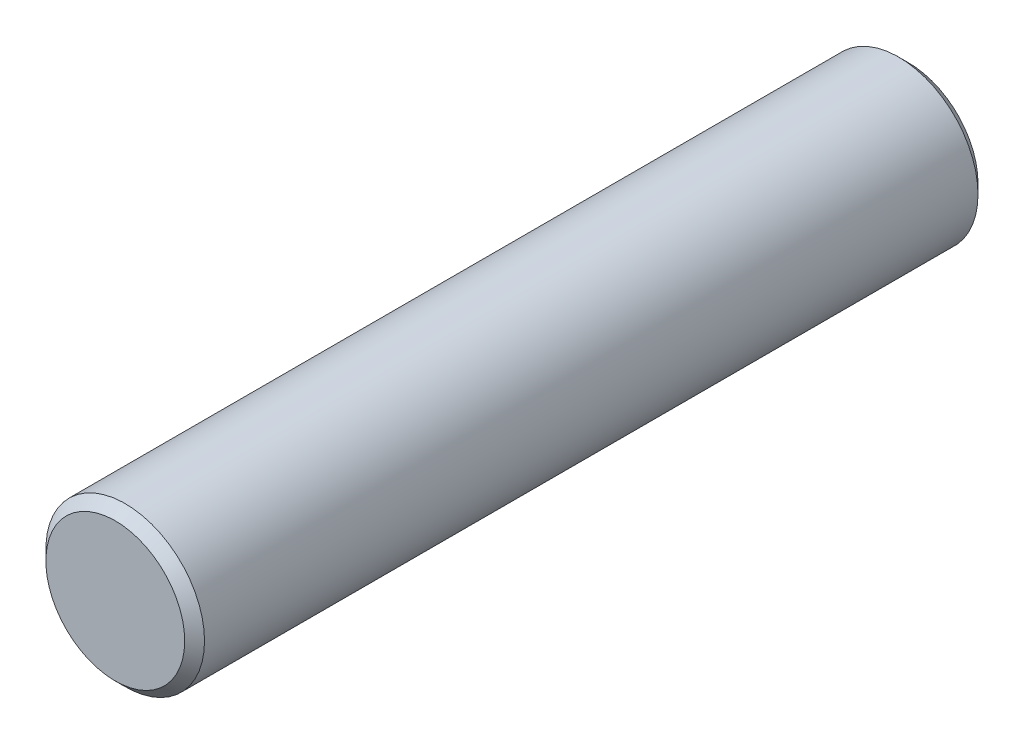
ISO-10303-21;
HEADER;
FILE_DESCRIPTION(('STEP AP214'),'2;1');
FILE_NAME('part.step','',(''),(''),'','','');
FILE_SCHEMA(('AUTOMOTIVE_DESIGN { 1 0 10303 214 1 1 1 1 }'));
ENDSEC;
DATA;
#1=APPLICATION_CONTEXT('core data for automotive mechanical design processes');
#2=APPLICATION_PROTOCOL_DEFINITION('international standard','automotive_design',2000,#1);
#3=PRODUCT_CONTEXT('',#1,'mechanical');
#4=PRODUCT('Part','Part','',(#3));
#5=PRODUCT_RELATED_PRODUCT_CATEGORY('part','',(#4));
#6=PRODUCT_DEFINITION_FORMATION('','',#4);
#7=PRODUCT_DEFINITION_CONTEXT('part definition',#1,'design');
#8=PRODUCT_DEFINITION('design','',#6,#7);
#9=PRODUCT_DEFINITION_SHAPE('','',#8);
#10=(LENGTH_UNIT() NAMED_UNIT(*) SI_UNIT(.MILLI.,.METRE.));
#11=(NAMED_UNIT(*) PLANE_ANGLE_UNIT() SI_UNIT($,.RADIAN.));
#12=(NAMED_UNIT(*) SI_UNIT($,.STERADIAN.) SOLID_ANGLE_UNIT());
#13=UNCERTAINTY_MEASURE_WITH_UNIT(LENGTH_MEASURE(1.E-05),#10,'distance_accuracy_value','');
#14=(GEOMETRIC_REPRESENTATION_CONTEXT(3) GLOBAL_UNCERTAINTY_ASSIGNED_CONTEXT((#13)) GLOBAL_UNIT_ASSIGNED_CONTEXT((#10,
#11,#12)) REPRESENTATION_CONTEXT('',''));
#15=CARTESIAN_POINT('',(0.,0.,0.));
#16=DIRECTION('',(0.,0.,1.));
#17=DIRECTION('',(1.,0.,0.));
#18=AXIS2_PLACEMENT_3D('',#15,#16,#17);
#19=CARTESIAN_POINT('',(0.,0.,40.));
#20=DIRECTION('',(0.,0.,-1.));
#21=DIRECTION('',(-1.,0.,0.));
#22=AXIS2_PLACEMENT_3D('',#19,#20,#21);
#23=CYLINDRICAL_SURFACE('',#22,4.);
#24=CARTESIAN_POINT('',(0.,0.,39.5));
#25=DIRECTION('',(0.,0.,1.));
#26=DIRECTION('',(1.,0.,0.));
#27=AXIS2_PLACEMENT_3D('',#24,#25,#26);
#28=CIRCLE('',#27,4.);
#29=CARTESIAN_POINT('',(4.,0.,39.5));
#30=VERTEX_POINT('',#29);
#31=EDGE_CURVE('E42',#30,#30,#28,.F.);
#32=ORIENTED_EDGE('',*,*,#31,.T.);
#33=EDGE_LOOP('',(#32));
#34=FACE_BOUND('',#33,.T.);
#35=CARTESIAN_POINT('',(0.,0.,0.500000000000007));
#36=DIRECTION('',(0.,0.,1.));
#37=DIRECTION('',(1.,0.,0.));
#38=AXIS2_PLACEMENT_3D('',#35,#36,#37);
#39=CIRCLE('',#38,4.);
#40=CARTESIAN_POINT('',(4.,0.,0.500000000000007));
#41=VERTEX_POINT('',#40);
#42=EDGE_CURVE('E46',#41,#41,#39,.T.);
#43=ORIENTED_EDGE('',*,*,#42,.T.);
#44=EDGE_LOOP('',(#43));
#45=FACE_BOUND('',#44,.T.);
#46=ADVANCED_FACE('F35',(#34,#45),#23,.T.);
#47=CARTESIAN_POINT('',(0.,0.,40.));
#48=DIRECTION('',(0.,0.,1.));
#49=DIRECTION('',(1.,0.,0.));
#50=AXIS2_PLACEMENT_3D('',#47,#48,#49);
#51=PLANE('',#50);
#52=CARTESIAN_POINT('',(0.,0.,40.));
#53=DIRECTION('',(0.,0.,1.));
#54=DIRECTION('',(1.,0.,0.));
#55=AXIS2_PLACEMENT_3D('',#52,#53,#54);
#56=CIRCLE('',#55,3.5);
#57=CARTESIAN_POINT('',(3.5,0.,40.));
#58=VERTEX_POINT('',#57);
#59=EDGE_CURVE('E50',#58,#58,#56,.T.);
#60=ORIENTED_EDGE('',*,*,#59,.T.);
#61=EDGE_LOOP('',(#60));
#62=FACE_BOUND('',#61,.T.);
#63=ADVANCED_FACE('F56',(#62),#51,.T.);
#64=CARTESIAN_POINT('',(0.,0.,0.));
#65=DIRECTION('',(0.,0.,1.));
#66=DIRECTION('',(1.,0.,0.));
#67=AXIS2_PLACEMENT_3D('',#64,#65,#66);
#68=PLANE('',#67);
#69=CARTESIAN_POINT('',(0.,0.,0.));
#70=DIRECTION('',(0.,0.,1.));
#71=DIRECTION('',(1.,0.,0.));
#72=AXIS2_PLACEMENT_3D('',#69,#70,#71);
#73=CIRCLE('',#72,3.5);
#74=CARTESIAN_POINT('',(3.5,0.,0.));
#75=VERTEX_POINT('',#74);
#76=EDGE_CURVE('E10',#75,#75,#73,.F.);
#77=ORIENTED_EDGE('',*,*,#76,.T.);
#78=EDGE_LOOP('',(#77));
#79=FACE_BOUND('',#78,.T.);
#80=ADVANCED_FACE('F60',(#79),#68,.F.);
#81=CARTESIAN_POINT('',(0.,0.,40.));
#82=DIRECTION('',(0.,0.,-1.));
#83=DIRECTION('',(-1.,0.,0.));
#84=AXIS2_PLACEMENT_3D('',#81,#82,#83);
#85=CONICAL_SURFACE('',#84,3.5,0.785398163397459);
#86=ORIENTED_EDGE('',*,*,#31,.F.);
#87=EDGE_LOOP('',(#86));
#88=FACE_BOUND('',#87,.T.);
#89=ORIENTED_EDGE('',*,*,#59,.F.);
#90=EDGE_LOOP('',(#89));
#91=FACE_BOUND('',#90,.T.);
#92=ADVANCED_FACE('F58',(#88,#91),#85,.T.);
#93=CARTESIAN_POINT('',(0.,0.,0.500000000000007));
#94=DIRECTION('',(0.,0.,1.));
#95=DIRECTION('',(1.,0.,0.));
#96=AXIS2_PLACEMENT_3D('',#93,#94,#95);
#97=CONICAL_SURFACE('',#96,4.,0.785398163397445);
#98=ORIENTED_EDGE('',*,*,#76,.F.);
#99=EDGE_LOOP('',(#98));
#100=FACE_BOUND('',#99,.T.);
#101=ORIENTED_EDGE('',*,*,#42,.F.);
#102=EDGE_LOOP('',(#101));
#103=FACE_BOUND('',#102,.T.);
#104=ADVANCED_FACE('F37',(#100,#103),#97,.T.);
#105=CLOSED_SHELL('',(#46,#63,#80,#92,#104));
#106=MANIFOLD_SOLID_BREP('B2',#105);
#107=ADVANCED_BREP_SHAPE_REPRESENTATION('',(#18,#106),#14);
#108=SHAPE_DEFINITION_REPRESENTATION(#9,#107);
ENDSEC;
END-ISO-10303-21;
